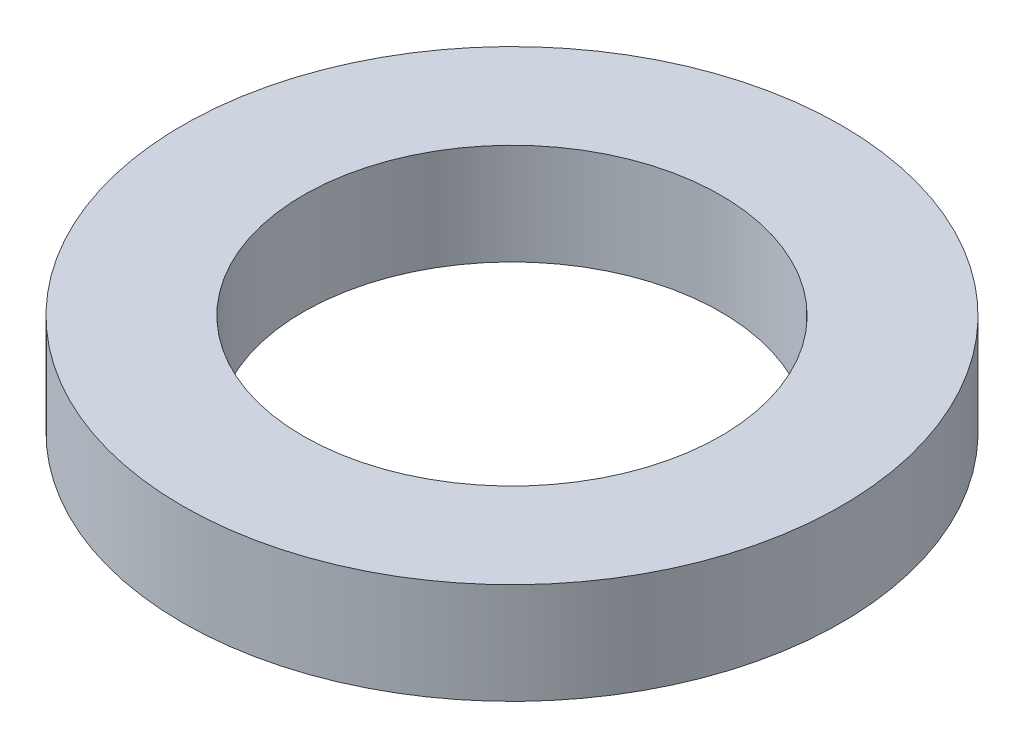
ISO-10303-21;
HEADER;
FILE_DESCRIPTION(('STEP AP214'),'2;1');
FILE_NAME('part.step','',(''),(''),'','','');
FILE_SCHEMA(('AUTOMOTIVE_DESIGN { 1 0 10303 214 1 1 1 1 }'));
ENDSEC;
DATA;
#1=APPLICATION_CONTEXT('core data for automotive mechanical design processes');
#2=APPLICATION_PROTOCOL_DEFINITION('international standard','automotive_design',2000,#1);
#3=PRODUCT_CONTEXT('',#1,'mechanical');
#4=PRODUCT('Part','Part','',(#3));
#5=PRODUCT_RELATED_PRODUCT_CATEGORY('part','',(#4));
#6=PRODUCT_DEFINITION_FORMATION('','',#4);
#7=PRODUCT_DEFINITION_CONTEXT('part definition',#1,'design');
#8=PRODUCT_DEFINITION('design','',#6,#7);
#9=PRODUCT_DEFINITION_SHAPE('','',#8);
#10=(LENGTH_UNIT() NAMED_UNIT(*) SI_UNIT(.MILLI.,.METRE.));
#11=(NAMED_UNIT(*) PLANE_ANGLE_UNIT() SI_UNIT($,.RADIAN.));
#12=(NAMED_UNIT(*) SI_UNIT($,.STERADIAN.) SOLID_ANGLE_UNIT());
#13=UNCERTAINTY_MEASURE_WITH_UNIT(LENGTH_MEASURE(1.E-05),#10,'distance_accuracy_value','');
#14=(GEOMETRIC_REPRESENTATION_CONTEXT(3) GLOBAL_UNCERTAINTY_ASSIGNED_CONTEXT((#13)) GLOBAL_UNIT_ASSIGNED_CONTEXT((#10,
#11,#12)) REPRESENTATION_CONTEXT('',''));
#15=CARTESIAN_POINT('',(0.,0.,0.));
#16=DIRECTION('',(0.,0.,1.));
#17=DIRECTION('',(1.,0.,0.));
#18=AXIS2_PLACEMENT_3D('',#15,#16,#17);
#19=CARTESIAN_POINT('',(0.,23.,0.));
#20=DIRECTION('',(0.,-1.,0.));
#21=DIRECTION('',(0.,0.,-1.));
#22=AXIS2_PLACEMENT_3D('',#19,#20,#21);
#23=CYLINDRICAL_SURFACE('',#22,75.);
#24=CARTESIAN_POINT('',(0.,23.,0.));
#25=DIRECTION('',(0.,1.,0.));
#26=DIRECTION('',(0.,0.,1.));
#27=AXIS2_PLACEMENT_3D('',#24,#25,#26);
#28=CIRCLE('',#27,75.);
#29=CARTESIAN_POINT('',(0.,23.,75.));
#30=VERTEX_POINT('',#29);
#31=EDGE_CURVE('E10',#30,#30,#28,.T.);
#32=ORIENTED_EDGE('',*,*,#31,.F.);
#33=EDGE_LOOP('',(#32));
#34=FACE_BOUND('',#33,.T.);
#35=CARTESIAN_POINT('',(0.,0.,0.));
#36=DIRECTION('',(0.,1.,0.));
#37=DIRECTION('',(0.,0.,1.));
#38=AXIS2_PLACEMENT_3D('',#35,#36,#37);
#39=CIRCLE('',#38,75.);
#40=CARTESIAN_POINT('',(0.,0.,75.));
#41=VERTEX_POINT('',#40);
#42=EDGE_CURVE('E37',#41,#41,#39,.T.);
#43=ORIENTED_EDGE('',*,*,#42,.T.);
#44=EDGE_LOOP('',(#43));
#45=FACE_BOUND('',#44,.T.);
#46=ADVANCED_FACE('F40',(#34,#45),#23,.T.);
#47=CARTESIAN_POINT('',(0.,23.,0.));
#48=DIRECTION('',(0.,1.,0.));
#49=DIRECTION('',(0.,0.,1.));
#50=AXIS2_PLACEMENT_3D('',#47,#48,#49);
#51=PLANE('',#50);
#52=CARTESIAN_POINT('',(0.,23.,0.));
#53=DIRECTION('',(0.,1.,0.));
#54=DIRECTION('',(0.,0.,1.));
#55=AXIS2_PLACEMENT_3D('',#52,#53,#54);
#56=CIRCLE('',#55,47.5);
#57=CARTESIAN_POINT('',(0.,23.,47.5));
#58=VERTEX_POINT('',#57);
#59=EDGE_CURVE('E50',#58,#58,#56,.T.);
#60=ORIENTED_EDGE('',*,*,#59,.F.);
#61=EDGE_LOOP('',(#60));
#62=FACE_BOUND('',#61,.T.);
#63=ORIENTED_EDGE('',*,*,#31,.T.);
#64=EDGE_LOOP('',(#63));
#65=FACE_BOUND('',#64,.T.);
#66=ADVANCED_FACE('F59',(#62,#65),#51,.T.);
#67=CARTESIAN_POINT('',(0.,0.,0.));
#68=DIRECTION('',(0.,1.,0.));
#69=DIRECTION('',(0.,0.,1.));
#70=AXIS2_PLACEMENT_3D('',#67,#68,#69);
#71=PLANE('',#70);
#72=CARTESIAN_POINT('',(0.,0.,0.));
#73=DIRECTION('',(0.,1.,0.));
#74=DIRECTION('',(0.,0.,1.));
#75=AXIS2_PLACEMENT_3D('',#72,#73,#74);
#76=CIRCLE('',#75,47.5);
#77=CARTESIAN_POINT('',(0.,0.,47.5));
#78=VERTEX_POINT('',#77);
#79=EDGE_CURVE('E47',#78,#78,#76,.T.);
#80=ORIENTED_EDGE('',*,*,#79,.T.);
#81=EDGE_LOOP('',(#80));
#82=FACE_BOUND('',#81,.T.);
#83=ORIENTED_EDGE('',*,*,#42,.F.);
#84=EDGE_LOOP('',(#83));
#85=FACE_BOUND('',#84,.T.);
#86=ADVANCED_FACE('F58',(#82,#85),#71,.F.);
#87=CARTESIAN_POINT('',(0.,23.,0.));
#88=DIRECTION('',(0.,-1.,0.));
#89=DIRECTION('',(0.,0.,-1.));
#90=AXIS2_PLACEMENT_3D('',#87,#88,#89);
#91=CYLINDRICAL_SURFACE('',#90,47.5);
#92=ORIENTED_EDGE('',*,*,#59,.T.);
#93=EDGE_LOOP('',(#92));
#94=FACE_BOUND('',#93,.T.);
#95=ORIENTED_EDGE('',*,*,#79,.F.);
#96=EDGE_LOOP('',(#95));
#97=FACE_BOUND('',#96,.T.);
#98=ADVANCED_FACE('F54',(#94,#97),#91,.F.);
#99=CLOSED_SHELL('',(#46,#66,#86,#98));
#100=MANIFOLD_SOLID_BREP('B2',#99);
#101=ADVANCED_BREP_SHAPE_REPRESENTATION('',(#18,#100),#14);
#102=SHAPE_DEFINITION_REPRESENTATION(#9,#101);
ENDSEC;
END-ISO-10303-21;
